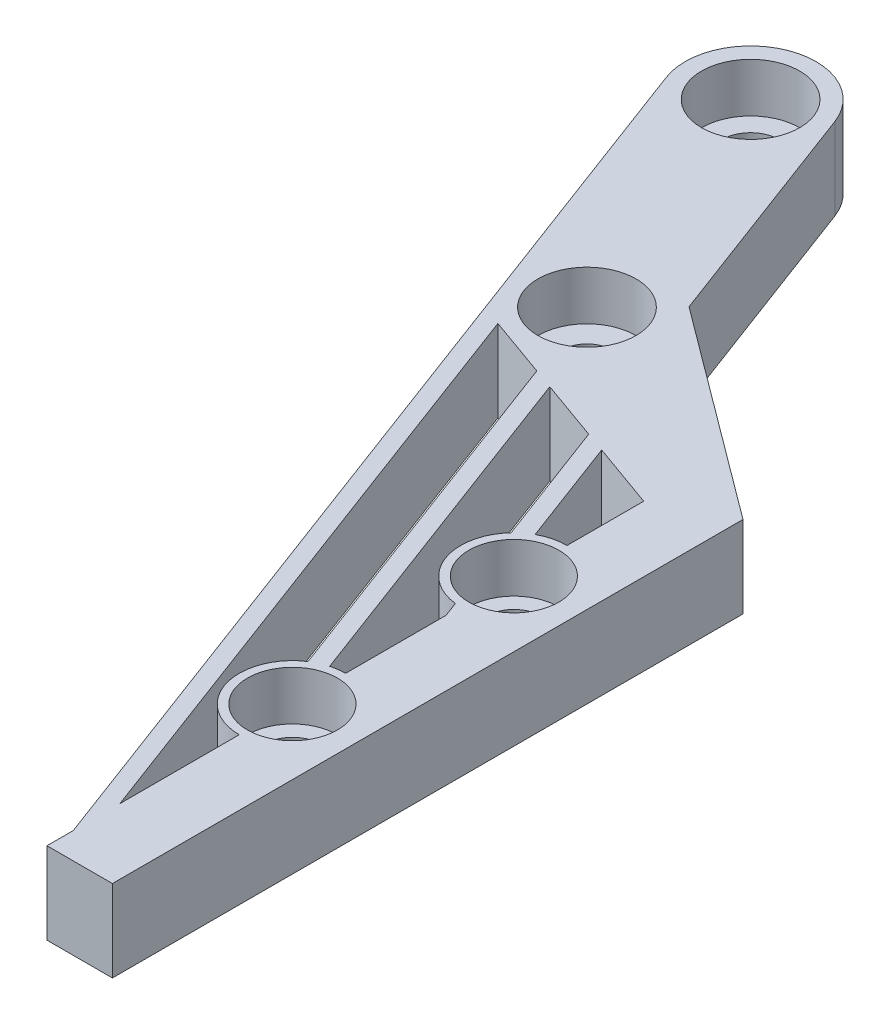
ISO-10303-21;
HEADER;
FILE_DESCRIPTION(('STEP AP214'),'2;1');
FILE_NAME('part.step','',(''),(''),'','','');
FILE_SCHEMA(('AUTOMOTIVE_DESIGN { 1 0 10303 214 1 1 1 1 }'));
ENDSEC;
DATA;
#1=APPLICATION_CONTEXT('core data for automotive mechanical design processes');
#2=APPLICATION_PROTOCOL_DEFINITION('international standard','automotive_design',2000,#1);
#3=PRODUCT_CONTEXT('',#1,'mechanical');
#4=PRODUCT('Part','Part','',(#3));
#5=PRODUCT_RELATED_PRODUCT_CATEGORY('part','',(#4));
#6=PRODUCT_DEFINITION_FORMATION('','',#4);
#7=PRODUCT_DEFINITION_CONTEXT('part definition',#1,'design');
#8=PRODUCT_DEFINITION('design','',#6,#7);
#9=PRODUCT_DEFINITION_SHAPE('','',#8);
#10=(LENGTH_UNIT() NAMED_UNIT(*) SI_UNIT(.MILLI.,.METRE.));
#11=(NAMED_UNIT(*) PLANE_ANGLE_UNIT() SI_UNIT($,.RADIAN.));
#12=(NAMED_UNIT(*) SI_UNIT($,.STERADIAN.) SOLID_ANGLE_UNIT());
#13=UNCERTAINTY_MEASURE_WITH_UNIT(LENGTH_MEASURE(1.E-05),#10,'distance_accuracy_value','');
#14=(GEOMETRIC_REPRESENTATION_CONTEXT(3) GLOBAL_UNCERTAINTY_ASSIGNED_CONTEXT((#13)) GLOBAL_UNIT_ASSIGNED_CONTEXT((#10,
#11,#12)) REPRESENTATION_CONTEXT('',''));
#15=CARTESIAN_POINT('',(0.,0.,0.));
#16=DIRECTION('',(0.,0.,1.));
#17=DIRECTION('',(1.,0.,0.));
#18=AXIS2_PLACEMENT_3D('',#15,#16,#17);
#19=CARTESIAN_POINT('',(0.,5.,0.));
#20=DIRECTION('',(0.,-1.,0.));
#21=DIRECTION('',(0.,0.,-1.));
#22=AXIS2_PLACEMENT_3D('',#19,#20,#21);
#23=CYLINDRICAL_SURFACE('',#22,1.75);
#24=CARTESIAN_POINT('',(0.,0.,0.));
#25=DIRECTION('',(0.,1.,0.));
#26=DIRECTION('',(0.,0.,1.));
#27=AXIS2_PLACEMENT_3D('',#24,#25,#26);
#28=CIRCLE('',#27,1.75);
#29=CARTESIAN_POINT('',(0.,0.,1.75));
#30=VERTEX_POINT('',#29);
#31=EDGE_CURVE('E228',#30,#30,#28,.T.);
#32=ORIENTED_EDGE('',*,*,#31,.F.);
#33=EDGE_LOOP('',(#32));
#34=FACE_BOUND('',#33,.T.);
#35=CARTESIAN_POINT('',(0.,2.,0.));
#36=DIRECTION('',(0.,1.,0.));
#37=DIRECTION('',(0.,0.,1.));
#38=AXIS2_PLACEMENT_3D('',#35,#36,#37);
#39=CIRCLE('',#38,1.75);
#40=CARTESIAN_POINT('',(0.,2.,1.75));
#41=VERTEX_POINT('',#40);
#42=EDGE_CURVE('E40',#41,#41,#39,.T.);
#43=ORIENTED_EDGE('',*,*,#42,.T.);
#44=EDGE_LOOP('',(#43));
#45=FACE_BOUND('',#44,.T.);
#46=ADVANCED_FACE('F36',(#34,#45),#23,.F.);
#47=CARTESIAN_POINT('',(6.,5.,16.));
#48=DIRECTION('',(0.,-1.,0.));
#49=DIRECTION('',(0.,0.,-1.));
#50=AXIS2_PLACEMENT_3D('',#47,#48,#49);
#51=CYLINDRICAL_SURFACE('',#50,1.5);
#52=CARTESIAN_POINT('',(6.,0.,16.));
#53=DIRECTION('',(0.,1.,0.));
#54=DIRECTION('',(0.,0.,1.));
#55=AXIS2_PLACEMENT_3D('',#52,#53,#54);
#56=CIRCLE('',#55,1.5);
#57=CARTESIAN_POINT('',(6.,0.,17.5));
#58=VERTEX_POINT('',#57);
#59=EDGE_CURVE('E350',#58,#58,#56,.T.);
#60=ORIENTED_EDGE('',*,*,#59,.F.);
#61=EDGE_LOOP('',(#60));
#62=FACE_BOUND('',#61,.T.);
#63=CARTESIAN_POINT('',(6.,2.,16.));
#64=DIRECTION('',(0.,1.,0.));
#65=DIRECTION('',(0.,0.,1.));
#66=AXIS2_PLACEMENT_3D('',#63,#64,#65);
#67=CIRCLE('',#66,1.5);
#68=CARTESIAN_POINT('',(6.,2.,17.5));
#69=VERTEX_POINT('',#68);
#70=EDGE_CURVE('E269',#69,#69,#67,.T.);
#71=ORIENTED_EDGE('',*,*,#70,.T.);
#72=EDGE_LOOP('',(#71));
#73=FACE_BOUND('',#72,.T.);
#74=ADVANCED_FACE('F499',(#62,#73),#51,.F.);
#75=CARTESIAN_POINT('',(18.,-4.94974746830584,46.));
#76=DIRECTION('',(0.,1.,0.));
#77=DIRECTION('',(0.,0.,1.));
#78=AXIS2_PLACEMENT_3D('',#75,#76,#77);
#79=CYLINDRICAL_SURFACE('',#78,1.75);
#80=CARTESIAN_POINT('',(18.,0.,46.));
#81=DIRECTION('',(0.,1.,0.));
#82=DIRECTION('',(0.,0.,1.));
#83=AXIS2_PLACEMENT_3D('',#80,#81,#82);
#84=CIRCLE('',#83,1.75);
#85=CARTESIAN_POINT('',(18.,0.,47.75));
#86=VERTEX_POINT('',#85);
#87=EDGE_CURVE('E274',#86,#86,#84,.F.);
#88=ORIENTED_EDGE('',*,*,#87,.T.);
#89=EDGE_LOOP('',(#88));
#90=FACE_BOUND('',#89,.T.);
#91=CARTESIAN_POINT('',(18.,2.,46.));
#92=DIRECTION('',(0.,1.,0.));
#93=DIRECTION('',(0.,0.,1.));
#94=AXIS2_PLACEMENT_3D('',#91,#92,#93);
#95=CIRCLE('',#94,1.75);
#96=CARTESIAN_POINT('',(18.,2.,47.75));
#97=VERTEX_POINT('',#96);
#98=EDGE_CURVE('E266',#97,#97,#95,.F.);
#99=ORIENTED_EDGE('',*,*,#98,.F.);
#100=EDGE_LOOP('',(#99));
#101=FACE_BOUND('',#100,.T.);
#102=ADVANCED_FACE('F505',(#90,#101),#79,.F.);
#103=CARTESIAN_POINT('',(18.,-4.94974746830584,32.4668375007661));
#104=DIRECTION('',(0.,1.,0.));
#105=DIRECTION('',(0.,0.,1.));
#106=AXIS2_PLACEMENT_3D('',#103,#104,#105);
#107=CYLINDRICAL_SURFACE('',#106,1.75);
#108=CARTESIAN_POINT('',(18.,0.,32.4668375007661));
#109=DIRECTION('',(0.,1.,0.));
#110=DIRECTION('',(0.,0.,1.));
#111=AXIS2_PLACEMENT_3D('',#108,#109,#110);
#112=CIRCLE('',#111,1.75);
#113=CARTESIAN_POINT('',(18.,0.,34.2168375007661));
#114=VERTEX_POINT('',#113);
#115=EDGE_CURVE('E278',#114,#114,#112,.F.);
#116=ORIENTED_EDGE('',*,*,#115,.T.);
#117=EDGE_LOOP('',(#116));
#118=FACE_BOUND('',#117,.T.);
#119=CARTESIAN_POINT('',(18.,2.,32.4668375007661));
#120=DIRECTION('',(0.,1.,0.));
#121=DIRECTION('',(0.,0.,1.));
#122=AXIS2_PLACEMENT_3D('',#119,#120,#121);
#123=CIRCLE('',#122,1.75);
#124=CARTESIAN_POINT('',(18.,2.,34.2168375007661));
#125=VERTEX_POINT('',#124);
#126=EDGE_CURVE('E263',#125,#125,#123,.F.);
#127=ORIENTED_EDGE('',*,*,#126,.F.);
#128=EDGE_LOOP('',(#127));
#129=FACE_BOUND('',#128,.T.);
#130=ADVANCED_FACE('F548',(#118,#129),#107,.F.);
#131=CARTESIAN_POINT('',(12.7717220072743,-42.9863621817415,22.6659203589747));
#132=DIRECTION('',(-0.936329177569045,0.,0.351123441588392));
#133=DIRECTION('',(0.351123441588392,0.,0.936329177569045));
#134=AXIS2_PLACEMENT_3D('',#131,#132,#133);
#135=PLANE('',#134);
#136=DIRECTION('',(0.,1.,0.));
#137=VECTOR('',#136,1.);
#138=CARTESIAN_POINT('',(17.6590925102293,-9.19238815542513,35.6989083668547));
#139=LINE('',#138,#137);
#140=CARTESIAN_POINT('',(17.6590925102293,0.,35.6989083668547));
#141=VERTEX_POINT('',#140);
#142=CARTESIAN_POINT('',(17.6590925102293,5.,35.6989083668547));
#143=VERTEX_POINT('',#142);
#144=EDGE_CURVE('E45',#141,#143,#139,.T.);
#145=ORIENTED_EDGE('',*,*,#144,.F.);
#146=DIRECTION('',(-0.351123441588392,0.,-0.936329177569045));
#147=VECTOR('',#146,1.);
#148=CARTESIAN_POINT('',(12.7717220072743,0.,22.6659203589747));
#149=LINE('',#148,#147);
#150=CARTESIAN_POINT('',(18.,0.,36.6079950062433));
#151=VERTEX_POINT('',#150);
#152=EDGE_CURVE('E329',#151,#141,#149,.T.);
#153=ORIENTED_EDGE('',*,*,#152,.F.);
#154=DIRECTION('',(0.,1.,0.));
#155=VECTOR('',#154,1.);
#156=CARTESIAN_POINT('',(18.,-42.9863621817415,36.6079950062433));
#157=LINE('',#156,#155);
#158=CARTESIAN_POINT('',(18.,5.,36.6079950062433));
#159=VERTEX_POINT('',#158);
#160=EDGE_CURVE('E325',#151,#159,#157,.T.);
#161=ORIENTED_EDGE('',*,*,#160,.T.);
#162=DIRECTION('',(0.351123441588392,0.,0.936329177569045));
#163=VECTOR('',#162,1.);
#164=CARTESIAN_POINT('',(12.7717220072743,5.,22.6659203589747));
#165=LINE('',#164,#163);
#166=EDGE_CURVE('E311',#143,#159,#165,.T.);
#167=ORIENTED_EDGE('',*,*,#166,.F.);
#168=EDGE_LOOP('',(#145,#153,#161,#167));
#169=FACE_BOUND('',#168,.T.);
#170=ADVANCED_FACE('F457',(#169),#135,.T.);
#171=CARTESIAN_POINT('',(18.,5.,24.5331624992339));
#172=DIRECTION('',(1.,0.,0.));
#173=DIRECTION('',(0.,0.,-1.));
#174=AXIS2_PLACEMENT_3D('',#171,#172,#173);
#175=PLANE('',#174);
#176=DIRECTION('',(0.,0.,1.));
#177=VECTOR('',#176,1.);
#178=CARTESIAN_POINT('',(18.,0.,24.5331624992339));
#179=LINE('',#178,#177);
#180=CARTESIAN_POINT('',(18.,0.,24.5331624992339));
#181=VERTEX_POINT('',#180);
#182=CARTESIAN_POINT('',(18.,0.,29.2168375007661));
#183=VERTEX_POINT('',#182);
#184=EDGE_CURVE('E236',#181,#183,#179,.T.);
#185=ORIENTED_EDGE('',*,*,#184,.T.);
#186=DIRECTION('',(0.,1.,0.));
#187=VECTOR('',#186,1.);
#188=CARTESIAN_POINT('',(18.,-9.19238815542513,29.2168375007661));
#189=LINE('',#188,#187);
#190=CARTESIAN_POINT('',(18.,5.,29.2168375007661));
#191=VERTEX_POINT('',#190);
#192=EDGE_CURVE('E308',#183,#191,#189,.T.);
#193=ORIENTED_EDGE('',*,*,#192,.T.);
#194=DIRECTION('',(0.,0.,1.));
#195=VECTOR('',#194,1.);
#196=CARTESIAN_POINT('',(18.,5.,24.5331624992339));
#197=LINE('',#196,#195);
#198=CARTESIAN_POINT('',(18.,5.,24.5331624992339));
#199=VERTEX_POINT('',#198);
#200=EDGE_CURVE('E375',#199,#191,#197,.T.);
#201=ORIENTED_EDGE('',*,*,#200,.F.);
#202=DIRECTION('',(0.,-1.,0.));
#203=VECTOR('',#202,1.);
#204=CARTESIAN_POINT('',(18.,5.,24.5331624992339));
#205=LINE('',#204,#203);
#206=EDGE_CURVE('E254',#199,#181,#205,.T.);
#207=ORIENTED_EDGE('',*,*,#206,.T.);
#208=EDGE_LOOP('',(#185,#193,#201,#207));
#209=FACE_BOUND('',#208,.T.);
#210=ADVANCED_FACE('F521',(#209),#175,.F.);
#211=CARTESIAN_POINT('',(2.90648056938186,5.,19.1426198454417));
#212=DIRECTION('',(0.336336396998156,0.,-0.941741911594837));
#213=DIRECTION('',(-0.941741911594837,0.,-0.336336396998156));
#214=AXIS2_PLACEMENT_3D('',#211,#212,#213);
#215=PLANE('',#214);
#216=DIRECTION('',(0.941741911594837,0.,0.336336396998156));
#217=VECTOR('',#216,1.);
#218=CARTESIAN_POINT('',(2.90648056938186,5.,19.1426198454417));
#219=LINE('',#218,#217);
#220=CARTESIAN_POINT('',(14.0048771870108,5.,23.1063329231663));
#221=VERTEX_POINT('',#220);
#222=EDGE_CURVE('E369',#221,#199,#219,.T.);
#223=ORIENTED_EDGE('',*,*,#222,.F.);
#224=DIRECTION('',(0.,1.,0.));
#225=VECTOR('',#224,1.);
#226=CARTESIAN_POINT('',(14.0048771870108,-42.9863621817415,23.1063329231663));
#227=LINE('',#226,#225);
#228=CARTESIAN_POINT('',(14.0048771870108,0.,23.1063329231663));
#229=VERTEX_POINT('',#228);
#230=EDGE_CURVE('E316',#229,#221,#227,.T.);
#231=ORIENTED_EDGE('',*,*,#230,.F.);
#232=DIRECTION('',(0.941741911594837,0.,0.336336396998156));
#233=VECTOR('',#232,1.);
#234=CARTESIAN_POINT('',(2.90648056938186,0.,19.1426198454417));
#235=LINE('',#234,#233);
#236=EDGE_CURVE('E230',#229,#181,#235,.T.);
#237=ORIENTED_EDGE('',*,*,#236,.T.);
#238=ORIENTED_EDGE('',*,*,#206,.F.);
#239=EDGE_LOOP('',(#223,#231,#237,#238));
#240=FACE_BOUND('',#239,.T.);
#241=ADVANCED_FACE('F438',(#240),#215,.F.);
#242=CARTESIAN_POINT('',(18.,0.,42.75));
#243=VERTEX_POINT('',#242);
#244=EDGE_CURVE('E240',#151,#243,#179,.T.);
#245=ORIENTED_EDGE('',*,*,#244,.T.);
#246=DIRECTION('',(0.,1.,0.));
#247=VECTOR('',#246,1.);
#248=CARTESIAN_POINT('',(18.,-9.19238815542513,42.75));
#249=LINE('',#248,#247);
#250=CARTESIAN_POINT('',(18.,5.,42.75));
#251=VERTEX_POINT('',#250);
#252=EDGE_CURVE('E297',#243,#251,#249,.T.);
#253=ORIENTED_EDGE('',*,*,#252,.T.);
#254=EDGE_CURVE('E377',#159,#251,#197,.T.);
#255=ORIENTED_EDGE('',*,*,#254,.F.);
#256=ORIENTED_EDGE('',*,*,#160,.F.);
#257=EDGE_LOOP('',(#245,#253,#255,#256));
#258=FACE_BOUND('',#257,.T.);
#259=ADVANCED_FACE('F462',(#258),#175,.F.);
#260=CARTESIAN_POINT('',(9.07225646806461,0.,21.3446826663998));
#261=VERTEX_POINT('',#260);
#262=CARTESIAN_POINT('',(12.7717220072743,0.,22.6659203589747));
#263=VERTEX_POINT('',#262);
#264=EDGE_CURVE('E235',#261,#263,#235,.T.);
#265=ORIENTED_EDGE('',*,*,#264,.T.);
#266=DIRECTION('',(0.,1.,0.));
#267=VECTOR('',#266,1.);
#268=CARTESIAN_POINT('',(12.7717220072743,-42.9863621817415,22.6659203589747));
#269=LINE('',#268,#267);
#270=CARTESIAN_POINT('',(12.7717220072743,5.,22.6659203589747));
#271=VERTEX_POINT('',#270);
#272=EDGE_CURVE('E322',#263,#271,#269,.T.);
#273=ORIENTED_EDGE('',*,*,#272,.T.);
#274=CARTESIAN_POINT('',(9.07225646806461,5.,21.3446826663998));
#275=VERTEX_POINT('',#274);
#276=EDGE_CURVE('E374',#275,#271,#219,.T.);
#277=ORIENTED_EDGE('',*,*,#276,.F.);
#278=DIRECTION('',(0.,1.,0.));
#279=VECTOR('',#278,1.);
#280=CARTESIAN_POINT('',(9.07225646806461,-42.9863621817415,21.3446826663998));
#281=LINE('',#280,#279);
#282=EDGE_CURVE('E336',#261,#275,#281,.T.);
#283=ORIENTED_EDGE('',*,*,#282,.F.);
#284=EDGE_LOOP('',(#265,#273,#277,#283));
#285=FACE_BOUND('',#284,.T.);
#286=ADVANCED_FACE('F497',(#285),#215,.F.);
#287=CARTESIAN_POINT('',(18.,5.,49.25));
#288=VERTEX_POINT('',#287);
#289=CARTESIAN_POINT('',(18.,5.,56.5440037453176));
#290=VERTEX_POINT('',#289);
#291=EDGE_CURVE('E378',#288,#290,#197,.T.);
#292=ORIENTED_EDGE('',*,*,#291,.F.);
#293=DIRECTION('',(0.,1.,0.));
#294=VECTOR('',#293,1.);
#295=CARTESIAN_POINT('',(18.,-9.19238815542513,49.25));
#296=LINE('',#295,#294);
#297=CARTESIAN_POINT('',(18.,0.,49.25));
#298=VERTEX_POINT('',#297);
#299=EDGE_CURVE('E294',#288,#298,#296,.F.);
#300=ORIENTED_EDGE('',*,*,#299,.T.);
#301=CARTESIAN_POINT('',(18.,0.,56.5440037453176));
#302=VERTEX_POINT('',#301);
#303=EDGE_CURVE('E241',#298,#302,#179,.T.);
#304=ORIENTED_EDGE('',*,*,#303,.T.);
#305=DIRECTION('',(0.,1.,0.));
#306=VECTOR('',#305,1.);
#307=CARTESIAN_POINT('',(18.,-42.9863621817415,56.5440037453176));
#308=LINE('',#307,#306);
#309=EDGE_CURVE('E357',#302,#290,#308,.T.);
#310=ORIENTED_EDGE('',*,*,#309,.T.);
#311=EDGE_LOOP('',(#292,#300,#304,#310));
#312=FACE_BOUND('',#311,.T.);
#313=ADVANCED_FACE('F420',(#312),#175,.F.);
#314=CARTESIAN_POINT('',(0.,5.,0.));
#315=DIRECTION('',(0.,1.,0.));
#316=DIRECTION('',(0.,0.,1.));
#317=AXIS2_PLACEMENT_3D('',#314,#315,#316);
#318=PLANE('',#317);
#319=DIRECTION('',(0.802095252658659,0.,0.597196119932508));
#320=VECTOR('',#319,1.);
#321=CARTESIAN_POINT('',(9.09351943061815,5.,12.8573801545583));
#322=LINE('',#321,#320);
#323=CARTESIAN_POINT('',(9.09351943061815,5.,12.8573801545583));
#324=VERTEX_POINT('',#323);
#325=CARTESIAN_POINT('',(22.,5.,22.4668375007661));
#326=VERTEX_POINT('',#325);
#327=EDGE_CURVE('E194',#324,#326,#322,.T.);
#328=ORIENTED_EDGE('',*,*,#327,.F.);
#329=DIRECTION('',(-0.351123441588392,0.,-0.936329177569044));
#330=VECTOR('',#329,1.);
#331=CARTESIAN_POINT('',(3.74531671027618,5.,-1.40449376635357));
#332=LINE('',#331,#330);
#333=CARTESIAN_POINT('',(3.74531671027618,5.,-1.40449376635357));
#334=VERTEX_POINT('',#333);
#335=EDGE_CURVE('E209',#324,#334,#332,.T.);
#336=ORIENTED_EDGE('',*,*,#335,.T.);
#337=CARTESIAN_POINT('',(0.,5.,0.));
#338=DIRECTION('',(0.,1.,0.));
#339=DIRECTION('',(0.,0.,1.));
#340=AXIS2_PLACEMENT_3D('',#337,#338,#339);
#341=CIRCLE('',#340,4.);
#342=CARTESIAN_POINT('',(-3.74531671027618,5.,1.40449376635357));
#343=VERTEX_POINT('',#342);
#344=EDGE_CURVE('E247',#334,#343,#341,.T.);
#345=ORIENTED_EDGE('',*,*,#344,.T.);
#346=DIRECTION('',(0.351123441588392,0.,0.936329177569044));
#347=VECTOR('',#346,1.);
#348=CARTESIAN_POINT('',(-3.74531671027618,5.,1.40449376635357));
#349=LINE('',#348,#347);
#350=CARTESIAN_POINT('',(18.,5.,59.3920049937567));
#351=VERTEX_POINT('',#350);
#352=EDGE_CURVE('E367',#343,#351,#349,.T.);
#353=ORIENTED_EDGE('',*,*,#352,.T.);
#354=CARTESIAN_POINT('',(18.,5.,61.));
#355=VERTEX_POINT('',#354);
#356=EDGE_CURVE('E373',#351,#355,#197,.T.);
#357=ORIENTED_EDGE('',*,*,#356,.T.);
#358=DIRECTION('',(1.,0.,0.));
#359=VECTOR('',#358,1.);
#360=CARTESIAN_POINT('',(18.,5.,61.));
#361=LINE('',#360,#359);
#362=CARTESIAN_POINT('',(22.,5.,61.));
#363=VERTEX_POINT('',#362);
#364=EDGE_CURVE('E220',#355,#363,#361,.T.);
#365=ORIENTED_EDGE('',*,*,#364,.T.);
#366=DIRECTION('',(0.,0.,-1.));
#367=VECTOR('',#366,1.);
#368=CARTESIAN_POINT('',(22.,5.,17.4668375007661));
#369=LINE('',#368,#367);
#370=EDGE_CURVE('E212',#363,#326,#369,.T.);
#371=ORIENTED_EDGE('',*,*,#370,.T.);
#372=EDGE_LOOP('',(#328,#336,#345,#353,#357,#365,#371));
#373=FACE_BOUND('',#372,.T.);
#374=CARTESIAN_POINT('',(0.,5.,0.));
#375=DIRECTION('',(0.,1.,0.));
#376=DIRECTION('',(0.,0.,1.));
#377=AXIS2_PLACEMENT_3D('',#374,#375,#376);
#378=CIRCLE('',#377,3.);
#379=CARTESIAN_POINT('',(0.,5.,3.));
#380=VERTEX_POINT('',#379);
#381=EDGE_CURVE('E395',#380,#380,#378,.T.);
#382=ORIENTED_EDGE('',*,*,#381,.F.);
#383=EDGE_LOOP('',(#382));
#384=FACE_BOUND('',#383,.T.);
#385=CARTESIAN_POINT('',(6.,5.,16.));
#386=DIRECTION('',(0.,1.,0.));
#387=DIRECTION('',(0.,0.,1.));
#388=AXIS2_PLACEMENT_3D('',#385,#386,#387);
#389=CIRCLE('',#388,3.);
#390=CARTESIAN_POINT('',(6.,5.,19.));
#391=VERTEX_POINT('',#390);
#392=EDGE_CURVE('E401',#391,#391,#389,.T.);
#393=ORIENTED_EDGE('',*,*,#392,.F.);
#394=EDGE_LOOP('',(#393));
#395=FACE_BOUND('',#394,.T.);
#396=CARTESIAN_POINT('',(18.,5.,32.4668375007661));
#397=DIRECTION('',(0.,1.,0.));
#398=DIRECTION('',(0.,0.,1.));
#399=AXIS2_PLACEMENT_3D('',#396,#397,#398);
#400=CIRCLE('',#399,2.75);
#401=CARTESIAN_POINT('',(18.,5.,35.2168375007661));
#402=VERTEX_POINT('',#401);
#403=EDGE_CURVE('E407',#402,#402,#400,.T.);
#404=ORIENTED_EDGE('',*,*,#403,.F.);
#405=EDGE_LOOP('',(#404));
#406=FACE_BOUND('',#405,.T.);
#407=CARTESIAN_POINT('',(18.,5.,46.));
#408=DIRECTION('',(0.,1.,0.));
#409=DIRECTION('',(0.,0.,1.));
#410=AXIS2_PLACEMENT_3D('',#407,#408,#409);
#411=CIRCLE('',#410,2.75);
#412=CARTESIAN_POINT('',(18.,5.,48.75));
#413=VERTEX_POINT('',#412);
#414=EDGE_CURVE('E390',#413,#413,#411,.T.);
#415=ORIENTED_EDGE('',*,*,#414,.F.);
#416=EDGE_LOOP('',(#415));
#417=FACE_BOUND('',#416,.T.);
#418=CARTESIAN_POINT('',(18.,5.,46.));
#419=DIRECTION('',(0.,1.,0.));
#420=DIRECTION('',(0.,0.,1.));
#421=AXIS2_PLACEMENT_3D('',#418,#419,#420);
#422=CIRCLE('',#421,3.25);
#423=CARTESIAN_POINT('',(16.2282724901686,5.,43.2753933071163));
#424=VERTEX_POINT('',#423);
#425=EDGE_CURVE('E283',#424,#288,#422,.T.);
#426=ORIENTED_EDGE('',*,*,#425,.T.);
#427=ORIENTED_EDGE('',*,*,#291,.T.);
#428=DIRECTION('',(-0.351123441588392,0.,-0.936329177569045));
#429=VECTOR('',#428,1.);
#430=CARTESIAN_POINT('',(4.13963574911841,5.,19.5830324096333));
#431=LINE('',#430,#429);
#432=CARTESIAN_POINT('',(4.13963574911841,5.,19.5830324096333));
#433=VERTEX_POINT('',#432);
#434=EDGE_CURVE('E346',#290,#433,#431,.T.);
#435=ORIENTED_EDGE('',*,*,#434,.T.);
#436=CARTESIAN_POINT('',(7.83910128832806,5.,20.9042701022082));
#437=VERTEX_POINT('',#436);
#438=EDGE_CURVE('E370',#433,#437,#219,.T.);
#439=ORIENTED_EDGE('',*,*,#438,.T.);
#440=DIRECTION('',(0.351123441588392,0.,0.936329177569045));
#441=VECTOR('',#440,1.);
#442=CARTESIAN_POINT('',(7.83910128832806,5.,20.9042701022082));
#443=LINE('',#442,#441);
#444=EDGE_CURVE('E331',#437,#424,#443,.T.);
#445=ORIENTED_EDGE('',*,*,#444,.T.);
#446=EDGE_LOOP('',(#426,#427,#435,#439,#445));
#447=FACE_BOUND('',#446,.T.);
#448=ORIENTED_EDGE('',*,*,#254,.T.);
#449=CARTESIAN_POINT('',(17.1424429950306,5.,42.8651800716424));
#450=VERTEX_POINT('',#449);
#451=EDGE_CURVE('E289',#251,#450,#422,.T.);
#452=ORIENTED_EDGE('',*,*,#451,.T.);
#453=DIRECTION('',(-0.351123441588392,0.,-0.936329177569044));
#454=VECTOR('',#453,1.);
#455=CARTESIAN_POINT('',(18.,5.,45.1519987515608));
#456=LINE('',#455,#454);
#457=EDGE_CURVE('E339',#450,#275,#456,.T.);
#458=ORIENTED_EDGE('',*,*,#457,.T.);
#459=ORIENTED_EDGE('',*,*,#276,.T.);
#460=CARTESIAN_POINT('',(15.617954609457,5.,30.2558739647953));
#461=VERTEX_POINT('',#460);
#462=EDGE_CURVE('E317',#271,#461,#165,.T.);
#463=ORIENTED_EDGE('',*,*,#462,.T.);
#464=CARTESIAN_POINT('',(18.,5.,32.4668375007661));
#465=DIRECTION('',(0.,1.,0.));
#466=DIRECTION('',(0.,0.,1.));
#467=AXIS2_PLACEMENT_3D('',#464,#465,#466);
#468=CIRCLE('',#467,3.25);
#469=EDGE_CURVE('E300',#461,#143,#468,.T.);
#470=ORIENTED_EDGE('',*,*,#469,.T.);
#471=ORIENTED_EDGE('',*,*,#166,.T.);
#472=EDGE_LOOP('',(#448,#452,#458,#459,#463,#470,#471));
#473=FACE_BOUND('',#472,.T.);
#474=CARTESIAN_POINT('',(16.4448934322859,5.,29.6130429105665));
#475=VERTEX_POINT('',#474);
#476=EDGE_CURVE('E301',#191,#475,#468,.T.);
#477=ORIENTED_EDGE('',*,*,#476,.T.);
#478=DIRECTION('',(-0.351123441588392,0.,-0.936329177569044));
#479=VECTOR('',#478,1.);
#480=CARTESIAN_POINT('',(18.,5.,33.7599937578041));
#481=LINE('',#480,#479);
#482=EDGE_CURVE('E320',#475,#221,#481,.T.);
#483=ORIENTED_EDGE('',*,*,#482,.T.);
#484=ORIENTED_EDGE('',*,*,#222,.T.);
#485=ORIENTED_EDGE('',*,*,#200,.T.);
#486=EDGE_LOOP('',(#477,#483,#484,#485));
#487=FACE_BOUND('',#486,.T.);
#488=ADVANCED_FACE('F206',(#373,#384,#395,#406,#417,#447,#473,#487),#318,.T.);
#489=CARTESIAN_POINT('',(0.,0.,0.));
#490=DIRECTION('',(0.,1.,0.));
#491=DIRECTION('',(0.,0.,1.));
#492=AXIS2_PLACEMENT_3D('',#489,#490,#491);
#493=PLANE('',#492);
#494=ORIENTED_EDGE('',*,*,#115,.F.);
#495=EDGE_LOOP('',(#494));
#496=FACE_BOUND('',#495,.T.);
#497=ORIENTED_EDGE('',*,*,#87,.F.);
#498=EDGE_LOOP('',(#497));
#499=FACE_BOUND('',#498,.T.);
#500=ORIENTED_EDGE('',*,*,#303,.F.);
#501=CARTESIAN_POINT('',(18.,0.,46.));
#502=DIRECTION('',(0.,1.,0.));
#503=DIRECTION('',(0.,0.,1.));
#504=AXIS2_PLACEMENT_3D('',#501,#502,#503);
#505=CIRCLE('',#504,3.25);
#506=CARTESIAN_POINT('',(16.2282724901686,0.,43.2753933071163));
#507=VERTEX_POINT('',#506);
#508=EDGE_CURVE('E53',#298,#507,#505,.F.);
#509=ORIENTED_EDGE('',*,*,#508,.T.);
#510=DIRECTION('',(-0.351123441588392,0.,-0.936329177569045));
#511=VECTOR('',#510,1.);
#512=CARTESIAN_POINT('',(7.83910128832806,0.,20.9042701022082));
#513=LINE('',#512,#511);
#514=CARTESIAN_POINT('',(7.83910128832806,0.,20.9042701022082));
#515=VERTEX_POINT('',#514);
#516=EDGE_CURVE('E335',#507,#515,#513,.T.);
#517=ORIENTED_EDGE('',*,*,#516,.T.);
#518=CARTESIAN_POINT('',(4.13963574911841,0.,19.5830324096333));
#519=VERTEX_POINT('',#518);
#520=EDGE_CURVE('E231',#519,#515,#235,.T.);
#521=ORIENTED_EDGE('',*,*,#520,.F.);
#522=DIRECTION('',(0.351123441588392,0.,0.936329177569045));
#523=VECTOR('',#522,1.);
#524=CARTESIAN_POINT('',(4.13963574911841,0.,19.5830324096333));
#525=LINE('',#524,#523);
#526=EDGE_CURVE('E347',#519,#302,#525,.T.);
#527=ORIENTED_EDGE('',*,*,#526,.T.);
#528=EDGE_LOOP('',(#500,#509,#517,#521,#527));
#529=FACE_BOUND('',#528,.T.);
#530=CARTESIAN_POINT('',(17.1424429950306,0.,42.8651800716424));
#531=VERTEX_POINT('',#530);
#532=EDGE_CURVE('E292',#531,#243,#505,.F.);
#533=ORIENTED_EDGE('',*,*,#532,.T.);
#534=ORIENTED_EDGE('',*,*,#244,.F.);
#535=ORIENTED_EDGE('',*,*,#152,.T.);
#536=CARTESIAN_POINT('',(18.,0.,32.4668375007661));
#537=DIRECTION('',(0.,1.,0.));
#538=DIRECTION('',(0.,0.,1.));
#539=AXIS2_PLACEMENT_3D('',#536,#537,#538);
#540=CIRCLE('',#539,3.25);
#541=CARTESIAN_POINT('',(15.617954609457,0.,30.2558739647953));
#542=VERTEX_POINT('',#541);
#543=EDGE_CURVE('E60',#141,#542,#540,.F.);
#544=ORIENTED_EDGE('',*,*,#543,.T.);
#545=EDGE_CURVE('E315',#542,#263,#149,.T.);
#546=ORIENTED_EDGE('',*,*,#545,.T.);
#547=ORIENTED_EDGE('',*,*,#264,.F.);
#548=DIRECTION('',(0.351123441588392,0.,0.936329177569045));
#549=VECTOR('',#548,1.);
#550=CARTESIAN_POINT('',(18.,0.,45.1519987515608));
#551=LINE('',#550,#549);
#552=EDGE_CURVE('E332',#261,#531,#551,.T.);
#553=ORIENTED_EDGE('',*,*,#552,.T.);
#554=EDGE_LOOP('',(#533,#534,#535,#544,#546,#547,#553));
#555=FACE_BOUND('',#554,.T.);
#556=DIRECTION('',(0.351123441588392,0.,0.936329177569044));
#557=VECTOR('',#556,1.);
#558=CARTESIAN_POINT('',(18.,0.,33.7599937578041));
#559=LINE('',#558,#557);
#560=CARTESIAN_POINT('',(16.4448934322859,0.,29.6130429105665));
#561=VERTEX_POINT('',#560);
#562=EDGE_CURVE('E312',#229,#561,#559,.T.);
#563=ORIENTED_EDGE('',*,*,#562,.T.);
#564=EDGE_CURVE('E304',#561,#183,#540,.F.);
#565=ORIENTED_EDGE('',*,*,#564,.T.);
#566=ORIENTED_EDGE('',*,*,#184,.F.);
#567=ORIENTED_EDGE('',*,*,#236,.F.);
#568=EDGE_LOOP('',(#563,#565,#566,#567));
#569=FACE_BOUND('',#568,.T.);
#570=DIRECTION('',(-0.351123441588392,0.,-0.936329177569044));
#571=VECTOR('',#570,1.);
#572=CARTESIAN_POINT('',(3.74531671027618,0.,-1.40449376635357));
#573=LINE('',#572,#571);
#574=CARTESIAN_POINT('',(9.09351943061815,0.,12.8573801545583));
#575=VERTEX_POINT('',#574);
#576=CARTESIAN_POINT('',(3.74531671027618,0.,-1.40449376635357));
#577=VERTEX_POINT('',#576);
#578=EDGE_CURVE('E246',#575,#577,#573,.T.);
#579=ORIENTED_EDGE('',*,*,#578,.F.);
#580=DIRECTION('',(-0.802095252658659,0.,-0.597196119932508));
#581=VECTOR('',#580,1.);
#582=CARTESIAN_POINT('',(9.09351943061815,0.,12.8573801545583));
#583=LINE('',#582,#581);
#584=CARTESIAN_POINT('',(22.,0.,22.4668375007661));
#585=VERTEX_POINT('',#584);
#586=EDGE_CURVE('E197',#585,#575,#583,.T.);
#587=ORIENTED_EDGE('',*,*,#586,.F.);
#588=DIRECTION('',(0.,0.,-1.));
#589=VECTOR('',#588,1.);
#590=CARTESIAN_POINT('',(22.,0.,17.4668375007661));
#591=LINE('',#590,#589);
#592=CARTESIAN_POINT('',(22.,0.,61.));
#593=VERTEX_POINT('',#592);
#594=EDGE_CURVE('E243',#593,#585,#591,.T.);
#595=ORIENTED_EDGE('',*,*,#594,.F.);
#596=DIRECTION('',(1.,0.,0.));
#597=VECTOR('',#596,1.);
#598=CARTESIAN_POINT('',(18.,0.,61.));
#599=LINE('',#598,#597);
#600=CARTESIAN_POINT('',(18.,0.,61.));
#601=VERTEX_POINT('',#600);
#602=EDGE_CURVE('E239',#601,#593,#599,.T.);
#603=ORIENTED_EDGE('',*,*,#602,.F.);
#604=CARTESIAN_POINT('',(18.,0.,59.3920049937567));
#605=VERTEX_POINT('',#604);
#606=EDGE_CURVE('E234',#605,#601,#179,.T.);
#607=ORIENTED_EDGE('',*,*,#606,.F.);
#608=DIRECTION('',(0.351123441588392,0.,0.936329177569044));
#609=VECTOR('',#608,1.);
#610=CARTESIAN_POINT('',(-3.74531671027618,0.,1.40449376635357));
#611=LINE('',#610,#609);
#612=CARTESIAN_POINT('',(-3.74531671027618,0.,1.40449376635357));
#613=VERTEX_POINT('',#612);
#614=EDGE_CURVE('E227',#613,#605,#611,.T.);
#615=ORIENTED_EDGE('',*,*,#614,.F.);
#616=CARTESIAN_POINT('',(0.,0.,0.));
#617=DIRECTION('',(0.,1.,0.));
#618=DIRECTION('',(0.,0.,1.));
#619=AXIS2_PLACEMENT_3D('',#616,#617,#618);
#620=CIRCLE('',#619,4.);
#621=EDGE_CURVE('E224',#577,#613,#620,.T.);
#622=ORIENTED_EDGE('',*,*,#621,.F.);
#623=EDGE_LOOP('',(#579,#587,#595,#603,#607,#615,#622));
#624=FACE_BOUND('',#623,.T.);
#625=ORIENTED_EDGE('',*,*,#31,.T.);
#626=EDGE_LOOP('',(#625));
#627=FACE_BOUND('',#626,.T.);
#628=ORIENTED_EDGE('',*,*,#59,.T.);
#629=EDGE_LOOP('',(#628));
#630=FACE_BOUND('',#629,.T.);
#631=ADVANCED_FACE('F419',(#496,#499,#529,#555,#569,#624,#627,#630),#493,.F.);
#632=CARTESIAN_POINT('',(0.,5.,0.));
#633=DIRECTION('',(0.,-1.,0.));
#634=DIRECTION('',(0.,0.,-1.));
#635=AXIS2_PLACEMENT_3D('',#632,#633,#634);
#636=CYLINDRICAL_SURFACE('',#635,4.);
#637=ORIENTED_EDGE('',*,*,#621,.T.);
#638=DIRECTION('',(0.,-1.,0.));
#639=VECTOR('',#638,1.);
#640=CARTESIAN_POINT('',(-3.74531671027618,5.,1.40449376635357));
#641=LINE('',#640,#639);
#642=EDGE_CURVE('E257',#343,#613,#641,.T.);
#643=ORIENTED_EDGE('',*,*,#642,.F.);
#644=ORIENTED_EDGE('',*,*,#344,.F.);
#645=DIRECTION('',(0.,-1.,0.));
#646=VECTOR('',#645,1.);
#647=CARTESIAN_POINT('',(3.74531671027618,5.,-1.40449376635357));
#648=LINE('',#647,#646);
#649=EDGE_CURVE('E202',#334,#577,#648,.T.);
#650=ORIENTED_EDGE('',*,*,#649,.T.);
#651=EDGE_LOOP('',(#637,#643,#644,#650));
#652=FACE_BOUND('',#651,.T.);
#653=ADVANCED_FACE('F38',(#652),#636,.T.);
#654=CARTESIAN_POINT('',(-3.74531671027618,5.,1.40449376635357));
#655=DIRECTION('',(0.936329177569044,0.,-0.351123441588392));
#656=DIRECTION('',(-0.351123441588392,0.,-0.936329177569045));
#657=AXIS2_PLACEMENT_3D('',#654,#655,#656);
#658=PLANE('',#657);
#659=ORIENTED_EDGE('',*,*,#614,.T.);
#660=DIRECTION('',(0.,1.,0.));
#661=VECTOR('',#660,1.);
#662=CARTESIAN_POINT('',(18.,-42.9863621817415,59.3920049937567));
#663=LINE('',#662,#661);
#664=EDGE_CURVE('E354',#605,#351,#663,.T.);
#665=ORIENTED_EDGE('',*,*,#664,.T.);
#666=ORIENTED_EDGE('',*,*,#352,.F.);
#667=ORIENTED_EDGE('',*,*,#642,.T.);
#668=EDGE_LOOP('',(#659,#665,#666,#667));
#669=FACE_BOUND('',#668,.T.);
#670=ADVANCED_FACE('F490',(#669),#658,.F.);
#671=ORIENTED_EDGE('',*,*,#520,.T.);
#672=DIRECTION('',(0.,1.,0.));
#673=VECTOR('',#672,1.);
#674=CARTESIAN_POINT('',(7.83910128832806,-42.9863621817415,20.9042701022082));
#675=LINE('',#674,#673);
#676=EDGE_CURVE('E341',#515,#437,#675,.T.);
#677=ORIENTED_EDGE('',*,*,#676,.T.);
#678=ORIENTED_EDGE('',*,*,#438,.F.);
#679=DIRECTION('',(0.,1.,0.));
#680=VECTOR('',#679,1.);
#681=CARTESIAN_POINT('',(4.13963574911841,-42.9863621817415,19.5830324096333));
#682=LINE('',#681,#680);
#683=EDGE_CURVE('E351',#519,#433,#682,.T.);
#684=ORIENTED_EDGE('',*,*,#683,.F.);
#685=EDGE_LOOP('',(#671,#677,#678,#684));
#686=FACE_BOUND('',#685,.T.);
#687=ADVANCED_FACE('F471',(#686),#215,.F.);
#688=ORIENTED_EDGE('',*,*,#356,.F.);
#689=ORIENTED_EDGE('',*,*,#664,.F.);
#690=ORIENTED_EDGE('',*,*,#606,.T.);
#691=DIRECTION('',(0.,-1.,0.));
#692=VECTOR('',#691,1.);
#693=CARTESIAN_POINT('',(18.,5.,61.));
#694=LINE('',#693,#692);
#695=EDGE_CURVE('E251',#355,#601,#694,.T.);
#696=ORIENTED_EDGE('',*,*,#695,.F.);
#697=EDGE_LOOP('',(#688,#689,#690,#696));
#698=FACE_BOUND('',#697,.T.);
#699=ADVANCED_FACE('F483',(#698),#175,.F.);
#700=CARTESIAN_POINT('',(18.,5.,61.));
#701=DIRECTION('',(0.,0.,-1.));
#702=DIRECTION('',(-1.,0.,0.));
#703=AXIS2_PLACEMENT_3D('',#700,#701,#702);
#704=PLANE('',#703);
#705=ORIENTED_EDGE('',*,*,#602,.T.);
#706=DIRECTION('',(0.,-1.,0.));
#707=VECTOR('',#706,1.);
#708=CARTESIAN_POINT('',(22.,5.,61.));
#709=LINE('',#708,#707);
#710=EDGE_CURVE('E201',#363,#593,#709,.T.);
#711=ORIENTED_EDGE('',*,*,#710,.F.);
#712=ORIENTED_EDGE('',*,*,#364,.F.);
#713=ORIENTED_EDGE('',*,*,#695,.T.);
#714=EDGE_LOOP('',(#705,#711,#712,#713));
#715=FACE_BOUND('',#714,.T.);
#716=ADVANCED_FACE('F384',(#715),#704,.F.);
#717=CARTESIAN_POINT('',(22.,5.,17.4668375007661));
#718=DIRECTION('',(-1.,0.,0.));
#719=DIRECTION('',(0.,0.,1.));
#720=AXIS2_PLACEMENT_3D('',#717,#718,#719);
#721=PLANE('',#720);
#722=ORIENTED_EDGE('',*,*,#594,.T.);
#723=DIRECTION('',(0.,1.,0.));
#724=VECTOR('',#723,1.);
#725=CARTESIAN_POINT('',(22.,-16.0909574350446,22.4668375007661));
#726=LINE('',#725,#724);
#727=EDGE_CURVE('E213',#585,#326,#726,.T.);
#728=ORIENTED_EDGE('',*,*,#727,.T.);
#729=ORIENTED_EDGE('',*,*,#370,.F.);
#730=ORIENTED_EDGE('',*,*,#710,.T.);
#731=EDGE_LOOP('',(#722,#728,#729,#730));
#732=FACE_BOUND('',#731,.T.);
#733=ADVANCED_FACE('F388',(#732),#721,.F.);
#734=CARTESIAN_POINT('',(3.74531671027618,5.,-1.40449376635357));
#735=DIRECTION('',(-0.936329177569044,0.,0.351123441588392));
#736=DIRECTION('',(0.351123441588392,0.,0.936329177569044));
#737=AXIS2_PLACEMENT_3D('',#734,#735,#736);
#738=PLANE('',#737);
#739=ORIENTED_EDGE('',*,*,#578,.T.);
#740=ORIENTED_EDGE('',*,*,#649,.F.);
#741=ORIENTED_EDGE('',*,*,#335,.F.);
#742=DIRECTION('',(0.,-1.,0.));
#743=VECTOR('',#742,1.);
#744=CARTESIAN_POINT('',(9.09351943061815,5.,12.8573801545583));
#745=LINE('',#744,#743);
#746=EDGE_CURVE('E191',#324,#575,#745,.T.);
#747=ORIENTED_EDGE('',*,*,#746,.T.);
#748=EDGE_LOOP('',(#739,#740,#741,#747));
#749=FACE_BOUND('',#748,.T.);
#750=ADVANCED_FACE('F215',(#749),#738,.F.);
#751=CARTESIAN_POINT('',(4.13963574911841,-42.9863621817415,19.5830324096333));
#752=DIRECTION('',(0.936329177569045,0.,-0.351123441588392));
#753=DIRECTION('',(-0.351123441588392,0.,-0.936329177569045));
#754=AXIS2_PLACEMENT_3D('',#751,#752,#753);
#755=PLANE('',#754);
#756=ORIENTED_EDGE('',*,*,#526,.F.);
#757=ORIENTED_EDGE('',*,*,#683,.T.);
#758=ORIENTED_EDGE('',*,*,#434,.F.);
#759=ORIENTED_EDGE('',*,*,#309,.F.);
#760=EDGE_LOOP('',(#756,#757,#758,#759));
#761=FACE_BOUND('',#760,.T.);
#762=ADVANCED_FACE('F468',(#761),#755,.T.);
#763=CARTESIAN_POINT('',(18.,-42.9863621817415,45.1519987515608));
#764=DIRECTION('',(0.936329177569045,0.,-0.351123441588392));
#765=DIRECTION('',(-0.351123441588392,0.,-0.936329177569045));
#766=AXIS2_PLACEMENT_3D('',#763,#764,#765);
#767=PLANE('',#766);
#768=DIRECTION('',(0.,1.,0.));
#769=VECTOR('',#768,1.);
#770=CARTESIAN_POINT('',(17.1424429950306,-9.19238815542513,42.8651800716424));
#771=LINE('',#770,#769);
#772=EDGE_CURVE('E291',#531,#450,#771,.T.);
#773=ORIENTED_EDGE('',*,*,#772,.F.);
#774=ORIENTED_EDGE('',*,*,#552,.F.);
#775=ORIENTED_EDGE('',*,*,#282,.T.);
#776=ORIENTED_EDGE('',*,*,#457,.F.);
#777=EDGE_LOOP('',(#773,#774,#775,#776));
#778=FACE_BOUND('',#777,.T.);
#779=ADVANCED_FACE('F633',(#778),#767,.T.);
#780=CARTESIAN_POINT('',(7.83910128832806,-42.9863621817415,20.9042701022082));
#781=DIRECTION('',(-0.936329177569045,0.,0.351123441588392));
#782=DIRECTION('',(0.351123441588392,0.,0.936329177569045));
#783=AXIS2_PLACEMENT_3D('',#780,#781,#782);
#784=PLANE('',#783);
#785=DIRECTION('',(0.,1.,0.));
#786=VECTOR('',#785,1.);
#787=CARTESIAN_POINT('',(16.2282724901686,-9.19238815542513,43.2753933071163));
#788=LINE('',#787,#786);
#789=EDGE_CURVE('E11',#424,#507,#788,.F.);
#790=ORIENTED_EDGE('',*,*,#789,.F.);
#791=ORIENTED_EDGE('',*,*,#444,.F.);
#792=ORIENTED_EDGE('',*,*,#676,.F.);
#793=ORIENTED_EDGE('',*,*,#516,.F.);
#794=EDGE_LOOP('',(#790,#791,#792,#793));
#795=FACE_BOUND('',#794,.T.);
#796=ADVANCED_FACE('F476',(#795),#784,.T.);
#797=CARTESIAN_POINT('',(18.,-42.9863621817415,33.7599937578041));
#798=DIRECTION('',(0.936329177569044,0.,-0.351123441588392));
#799=DIRECTION('',(-0.351123441588392,0.,-0.936329177569044));
#800=AXIS2_PLACEMENT_3D('',#797,#798,#799);
#801=PLANE('',#800);
#802=DIRECTION('',(0.,1.,0.));
#803=VECTOR('',#802,1.);
#804=CARTESIAN_POINT('',(16.4448934322859,-9.19238815542513,29.6130429105665));
#805=LINE('',#804,#803);
#806=EDGE_CURVE('E306',#561,#475,#805,.T.);
#807=ORIENTED_EDGE('',*,*,#806,.F.);
#808=ORIENTED_EDGE('',*,*,#562,.F.);
#809=ORIENTED_EDGE('',*,*,#230,.T.);
#810=ORIENTED_EDGE('',*,*,#482,.F.);
#811=EDGE_LOOP('',(#807,#808,#809,#810));
#812=FACE_BOUND('',#811,.T.);
#813=ADVANCED_FACE('F434',(#812),#801,.T.);
#814=DIRECTION('',(0.,1.,0.));
#815=VECTOR('',#814,1.);
#816=CARTESIAN_POINT('',(15.617954609457,-9.19238815542513,30.2558739647953));
#817=LINE('',#816,#815);
#818=EDGE_CURVE('E260',#461,#542,#817,.F.);
#819=ORIENTED_EDGE('',*,*,#818,.F.);
#820=ORIENTED_EDGE('',*,*,#462,.F.);
#821=ORIENTED_EDGE('',*,*,#272,.F.);
#822=ORIENTED_EDGE('',*,*,#545,.F.);
#823=EDGE_LOOP('',(#819,#820,#821,#822));
#824=FACE_BOUND('',#823,.T.);
#825=ADVANCED_FACE('F450',(#824),#135,.T.);
#826=CARTESIAN_POINT('',(18.,-9.19238815542513,32.4668375007661));
#827=DIRECTION('',(0.,1.,0.));
#828=DIRECTION('',(0.,0.,1.));
#829=AXIS2_PLACEMENT_3D('',#826,#827,#828);
#830=CYLINDRICAL_SURFACE('',#829,3.25);
#831=ORIENTED_EDGE('',*,*,#543,.F.);
#832=ORIENTED_EDGE('',*,*,#144,.T.);
#833=ORIENTED_EDGE('',*,*,#469,.F.);
#834=ORIENTED_EDGE('',*,*,#818,.T.);
#835=EDGE_LOOP('',(#831,#832,#833,#834));
#836=FACE_BOUND('',#835,.T.);
#837=ADVANCED_FACE('F453',(#836),#830,.T.);
#838=ORIENTED_EDGE('',*,*,#192,.F.);
#839=ORIENTED_EDGE('',*,*,#564,.F.);
#840=ORIENTED_EDGE('',*,*,#806,.T.);
#841=ORIENTED_EDGE('',*,*,#476,.F.);
#842=EDGE_LOOP('',(#838,#839,#840,#841));
#843=FACE_BOUND('',#842,.T.);
#844=ADVANCED_FACE('F594',(#843),#830,.T.);
#845=CARTESIAN_POINT('',(18.,-9.19238815542513,46.));
#846=DIRECTION('',(0.,1.,0.));
#847=DIRECTION('',(0.,0.,1.));
#848=AXIS2_PLACEMENT_3D('',#845,#846,#847);
#849=CYLINDRICAL_SURFACE('',#848,3.25);
#850=ORIENTED_EDGE('',*,*,#299,.F.);
#851=ORIENTED_EDGE('',*,*,#425,.F.);
#852=ORIENTED_EDGE('',*,*,#789,.T.);
#853=ORIENTED_EDGE('',*,*,#508,.F.);
#854=EDGE_LOOP('',(#850,#851,#852,#853));
#855=FACE_BOUND('',#854,.T.);
#856=ADVANCED_FACE('F479',(#855),#849,.T.);
#857=ORIENTED_EDGE('',*,*,#252,.F.);
#858=ORIENTED_EDGE('',*,*,#532,.F.);
#859=ORIENTED_EDGE('',*,*,#772,.T.);
#860=ORIENTED_EDGE('',*,*,#451,.F.);
#861=EDGE_LOOP('',(#857,#858,#859,#860));
#862=FACE_BOUND('',#861,.T.);
#863=ADVANCED_FACE('F578',(#862),#849,.T.);
#864=CARTESIAN_POINT('',(18.,2.,32.4668375007661));
#865=DIRECTION('',(0.,1.,0.));
#866=DIRECTION('',(0.,0.,1.));
#867=AXIS2_PLACEMENT_3D('',#864,#865,#866);
#868=PLANE('',#867);
#869=CARTESIAN_POINT('',(18.,2.,32.4668375007661));
#870=DIRECTION('',(0.,1.,0.));
#871=DIRECTION('',(0.,0.,1.));
#872=AXIS2_PLACEMENT_3D('',#869,#870,#871);
#873=CIRCLE('',#872,2.75);
#874=CARTESIAN_POINT('',(18.,2.,35.2168375007661));
#875=VERTEX_POINT('',#874);
#876=EDGE_CURVE('E404',#875,#875,#873,.T.);
#877=ORIENTED_EDGE('',*,*,#876,.T.);
#878=EDGE_LOOP('',(#877));
#879=FACE_BOUND('',#878,.T.);
#880=ORIENTED_EDGE('',*,*,#126,.T.);
#881=EDGE_LOOP('',(#880));
#882=FACE_BOUND('',#881,.T.);
#883=ADVANCED_FACE('F583',(#879,#882),#868,.T.);
#884=CARTESIAN_POINT('',(18.,2.,32.4668375007661));
#885=DIRECTION('',(0.,1.,0.));
#886=DIRECTION('',(0.,0.,1.));
#887=AXIS2_PLACEMENT_3D('',#884,#885,#886);
#888=CYLINDRICAL_SURFACE('',#887,2.75);
#889=ORIENTED_EDGE('',*,*,#876,.F.);
#890=EDGE_LOOP('',(#889));
#891=FACE_BOUND('',#890,.T.);
#892=ORIENTED_EDGE('',*,*,#403,.T.);
#893=EDGE_LOOP('',(#892));
#894=FACE_BOUND('',#893,.T.);
#895=ADVANCED_FACE('F786',(#891,#894),#888,.F.);
#896=CARTESIAN_POINT('',(18.,2.,46.));
#897=DIRECTION('',(0.,1.,0.));
#898=DIRECTION('',(0.,0.,1.));
#899=AXIS2_PLACEMENT_3D('',#896,#897,#898);
#900=PLANE('',#899);
#901=CARTESIAN_POINT('',(18.,2.,46.));
#902=DIRECTION('',(0.,1.,0.));
#903=DIRECTION('',(0.,0.,1.));
#904=AXIS2_PLACEMENT_3D('',#901,#902,#903);
#905=CIRCLE('',#904,2.75);
#906=CARTESIAN_POINT('',(18.,2.,48.75));
#907=VERTEX_POINT('',#906);
#908=EDGE_CURVE('E410',#907,#907,#905,.T.);
#909=ORIENTED_EDGE('',*,*,#908,.T.);
#910=EDGE_LOOP('',(#909));
#911=FACE_BOUND('',#910,.T.);
#912=ORIENTED_EDGE('',*,*,#98,.T.);
#913=EDGE_LOOP('',(#912));
#914=FACE_BOUND('',#913,.T.);
#915=ADVANCED_FACE('F778',(#911,#914),#900,.T.);
#916=CARTESIAN_POINT('',(18.,2.,46.));
#917=DIRECTION('',(0.,1.,0.));
#918=DIRECTION('',(0.,0.,1.));
#919=AXIS2_PLACEMENT_3D('',#916,#917,#918);
#920=CYLINDRICAL_SURFACE('',#919,2.75);
#921=ORIENTED_EDGE('',*,*,#908,.F.);
#922=EDGE_LOOP('',(#921));
#923=FACE_BOUND('',#922,.T.);
#924=ORIENTED_EDGE('',*,*,#414,.T.);
#925=EDGE_LOOP('',(#924));
#926=FACE_BOUND('',#925,.T.);
#927=ADVANCED_FACE('F415',(#923,#926),#920,.F.);
#928=CARTESIAN_POINT('',(6.,2.,16.));
#929=DIRECTION('',(0.,1.,0.));
#930=DIRECTION('',(0.,0.,1.));
#931=AXIS2_PLACEMENT_3D('',#928,#929,#930);
#932=CYLINDRICAL_SURFACE('',#931,3.);
#933=CARTESIAN_POINT('',(6.,2.,16.));
#934=DIRECTION('',(0.,1.,0.));
#935=DIRECTION('',(0.,0.,1.));
#936=AXIS2_PLACEMENT_3D('',#933,#934,#935);
#937=CIRCLE('',#936,3.);
#938=CARTESIAN_POINT('',(6.,2.,19.));
#939=VERTEX_POINT('',#938);
#940=EDGE_CURVE('E398',#939,#939,#937,.T.);
#941=ORIENTED_EDGE('',*,*,#940,.F.);
#942=EDGE_LOOP('',(#941));
#943=FACE_BOUND('',#942,.T.);
#944=ORIENTED_EDGE('',*,*,#392,.T.);
#945=EDGE_LOOP('',(#944));
#946=FACE_BOUND('',#945,.T.);
#947=ADVANCED_FACE('F763',(#943,#946),#932,.F.);
#948=CARTESIAN_POINT('',(6.,2.,16.));
#949=DIRECTION('',(0.,1.,0.));
#950=DIRECTION('',(0.,0.,1.));
#951=AXIS2_PLACEMENT_3D('',#948,#949,#950);
#952=PLANE('',#951);
#953=ORIENTED_EDGE('',*,*,#70,.F.);
#954=EDGE_LOOP('',(#953));
#955=FACE_BOUND('',#954,.T.);
#956=ORIENTED_EDGE('',*,*,#940,.T.);
#957=EDGE_LOOP('',(#956));
#958=FACE_BOUND('',#957,.T.);
#959=ADVANCED_FACE('F755',(#955,#958),#952,.T.);
#960=CARTESIAN_POINT('',(0.,2.,0.));
#961=DIRECTION('',(0.,1.,0.));
#962=DIRECTION('',(0.,0.,1.));
#963=AXIS2_PLACEMENT_3D('',#960,#961,#962);
#964=CYLINDRICAL_SURFACE('',#963,3.);
#965=CARTESIAN_POINT('',(0.,2.,0.));
#966=DIRECTION('',(0.,1.,0.));
#967=DIRECTION('',(0.,0.,1.));
#968=AXIS2_PLACEMENT_3D('',#965,#966,#967);
#969=CIRCLE('',#968,3.);
#970=CARTESIAN_POINT('',(0.,2.,3.));
#971=VERTEX_POINT('',#970);
#972=EDGE_CURVE('E267',#971,#971,#969,.T.);
#973=ORIENTED_EDGE('',*,*,#972,.F.);
#974=EDGE_LOOP('',(#973));
#975=FACE_BOUND('',#974,.T.);
#976=ORIENTED_EDGE('',*,*,#381,.T.);
#977=EDGE_LOOP('',(#976));
#978=FACE_BOUND('',#977,.T.);
#979=ADVANCED_FACE('F747',(#975,#978),#964,.F.);
#980=CARTESIAN_POINT('',(0.,2.,0.));
#981=DIRECTION('',(0.,1.,0.));
#982=DIRECTION('',(0.,0.,1.));
#983=AXIS2_PLACEMENT_3D('',#980,#981,#982);
#984=PLANE('',#983);
#985=ORIENTED_EDGE('',*,*,#42,.F.);
#986=EDGE_LOOP('',(#985));
#987=FACE_BOUND('',#986,.T.);
#988=ORIENTED_EDGE('',*,*,#972,.T.);
#989=EDGE_LOOP('',(#988));
#990=FACE_BOUND('',#989,.T.);
#991=ADVANCED_FACE('F737',(#987,#990),#984,.T.);
#992=CARTESIAN_POINT('',(9.09351943061815,-16.0909574350446,12.8573801545583));
#993=DIRECTION('',(-0.597196119932508,0.,0.802095252658659));
#994=DIRECTION('',(0.802095252658659,0.,0.597196119932508));
#995=AXIS2_PLACEMENT_3D('',#992,#993,#994);
#996=PLANE('',#995);
#997=ORIENTED_EDGE('',*,*,#586,.T.);
#998=ORIENTED_EDGE('',*,*,#746,.F.);
#999=ORIENTED_EDGE('',*,*,#327,.T.);
#1000=ORIENTED_EDGE('',*,*,#727,.F.);
#1001=EDGE_LOOP('',(#997,#998,#999,#1000));
#1002=FACE_BOUND('',#1001,.T.);
#1003=ADVANCED_FACE('F193',(#1002),#996,.F.);
#1004=CLOSED_SHELL('',(#46,#74,#102,#130,#170,#210,#241,#259,#286,#313,#488,#631,#653,#670,#687,
#699,#716,#733,#750,#762,#779,#796,#813,#825,#837,#844,#856,#863,#883,#895,#915,#927,#947,#959,
#979,#991,#1003));
#1005=MANIFOLD_SOLID_BREP('B2',#1004);
#1006=ADVANCED_BREP_SHAPE_REPRESENTATION('',(#18,#1005),#14);
#1007=SHAPE_DEFINITION_REPRESENTATION(#9,#1006);
ENDSEC;
END-ISO-10303-21;
